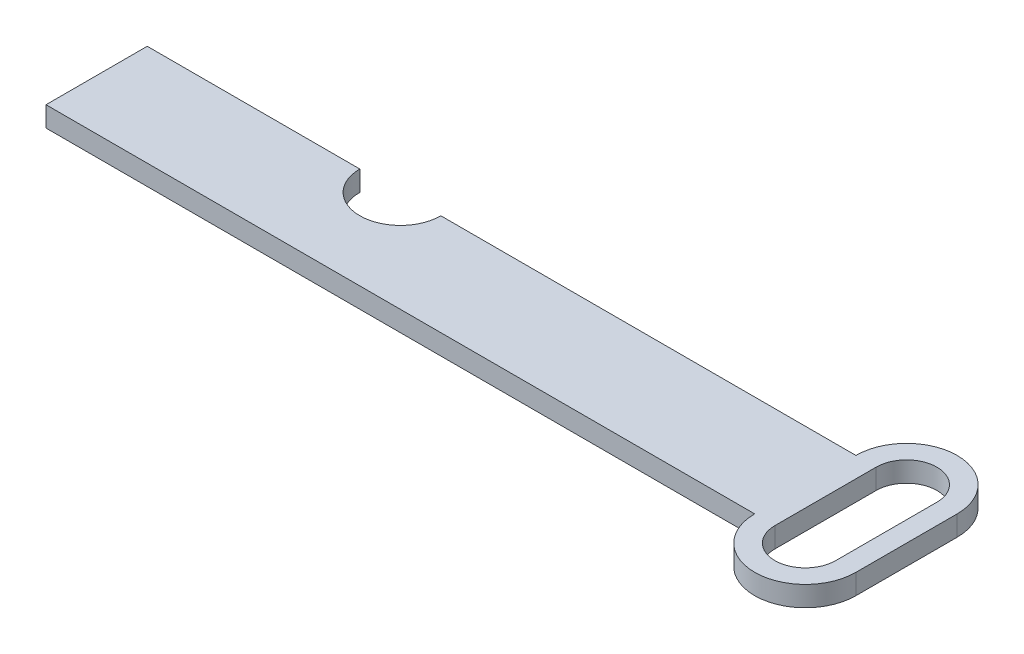
ISO-10303-21;
HEADER;
FILE_DESCRIPTION(('STEP AP214'),'2;1');
FILE_NAME('part.step','',(''),(''),'','','');
FILE_SCHEMA(('AUTOMOTIVE_DESIGN { 1 0 10303 214 1 1 1 1 }'));
ENDSEC;
DATA;
#1=APPLICATION_CONTEXT('core data for automotive mechanical design processes');
#2=APPLICATION_PROTOCOL_DEFINITION('international standard','automotive_design',2000,#1);
#3=PRODUCT_CONTEXT('',#1,'mechanical');
#4=PRODUCT('Part','Part','',(#3));
#5=PRODUCT_RELATED_PRODUCT_CATEGORY('part','',(#4));
#6=PRODUCT_DEFINITION_FORMATION('','',#4);
#7=PRODUCT_DEFINITION_CONTEXT('part definition',#1,'design');
#8=PRODUCT_DEFINITION('design','',#6,#7);
#9=PRODUCT_DEFINITION_SHAPE('','',#8);
#10=(LENGTH_UNIT() NAMED_UNIT(*) SI_UNIT(.MILLI.,.METRE.));
#11=(NAMED_UNIT(*) PLANE_ANGLE_UNIT() SI_UNIT($,.RADIAN.));
#12=(NAMED_UNIT(*) SI_UNIT($,.STERADIAN.) SOLID_ANGLE_UNIT());
#13=UNCERTAINTY_MEASURE_WITH_UNIT(LENGTH_MEASURE(1.E-05),#10,'distance_accuracy_value','');
#14=(GEOMETRIC_REPRESENTATION_CONTEXT(3) GLOBAL_UNCERTAINTY_ASSIGNED_CONTEXT((#13)) GLOBAL_UNIT_ASSIGNED_CONTEXT((#10,
#11,#12)) REPRESENTATION_CONTEXT('',''));
#15=CARTESIAN_POINT('',(0.,0.,0.));
#16=DIRECTION('',(0.,0.,1.));
#17=DIRECTION('',(1.,0.,0.));
#18=AXIS2_PLACEMENT_3D('',#15,#16,#17);
#19=CARTESIAN_POINT('',(25.,2.,-9.99999999999999));
#20=DIRECTION('',(0.,-1.,0.));
#21=DIRECTION('',(0.,0.,-1.));
#22=AXIS2_PLACEMENT_3D('',#19,#20,#21);
#23=CYLINDRICAL_SURFACE('',#22,4.);
#24=CARTESIAN_POINT('',(25.,0.,-9.99999999999999));
#25=DIRECTION('',(0.,1.,0.));
#26=DIRECTION('',(0.,0.,1.));
#27=AXIS2_PLACEMENT_3D('',#24,#25,#26);
#28=CIRCLE('',#27,4.);
#29=CARTESIAN_POINT('',(21.,0.,-9.99999999999999));
#30=VERTEX_POINT('',#29);
#31=CARTESIAN_POINT('',(29.,0.,-9.99999999999999));
#32=VERTEX_POINT('',#31);
#33=EDGE_CURVE('E162',#30,#32,#28,.T.);
#34=ORIENTED_EDGE('',*,*,#33,.F.);
#35=DIRECTION('',(0.,-1.,0.));
#36=VECTOR('',#35,1.);
#37=CARTESIAN_POINT('',(21.,2.,-9.99999999999999));
#38=LINE('',#37,#36);
#39=CARTESIAN_POINT('',(21.,2.,-9.99999999999999));
#40=VERTEX_POINT('',#39);
#41=EDGE_CURVE('E11',#40,#30,#38,.T.);
#42=ORIENTED_EDGE('',*,*,#41,.F.);
#43=CARTESIAN_POINT('',(25.,2.,-9.99999999999999));
#44=DIRECTION('',(0.,1.,0.));
#45=DIRECTION('',(0.,0.,1.));
#46=AXIS2_PLACEMENT_3D('',#43,#44,#45);
#47=CIRCLE('',#46,4.);
#48=CARTESIAN_POINT('',(29.,2.,-9.99999999999999));
#49=VERTEX_POINT('',#48);
#50=EDGE_CURVE('E174',#40,#49,#47,.T.);
#51=ORIENTED_EDGE('',*,*,#50,.T.);
#52=DIRECTION('',(0.,-1.,0.));
#53=VECTOR('',#52,1.);
#54=CARTESIAN_POINT('',(29.,2.,-9.99999999999999));
#55=LINE('',#54,#53);
#56=EDGE_CURVE('E199',#49,#32,#55,.T.);
#57=ORIENTED_EDGE('',*,*,#56,.T.);
#58=EDGE_LOOP('',(#34,#42,#51,#57));
#59=FACE_BOUND('',#58,.T.);
#60=ADVANCED_FACE('F35',(#59),#23,.F.);
#61=CARTESIAN_POINT('',(0.,2.,-9.99999999999999));
#62=DIRECTION('',(0.,0.,-1.));
#63=DIRECTION('',(-1.,0.,0.));
#64=AXIS2_PLACEMENT_3D('',#61,#62,#63);
#65=PLANE('',#64);
#66=DIRECTION('',(1.,0.,0.));
#67=VECTOR('',#66,1.);
#68=CARTESIAN_POINT('',(0.,0.,-9.99999999999999));
#69=LINE('',#68,#67);
#70=CARTESIAN_POINT('',(0.,0.,-9.99999999999999));
#71=VERTEX_POINT('',#70);
#72=EDGE_CURVE('E190',#71,#30,#69,.T.);
#73=ORIENTED_EDGE('',*,*,#72,.F.);
#74=DIRECTION('',(0.,-1.,0.));
#75=VECTOR('',#74,1.);
#76=CARTESIAN_POINT('',(0.,2.,-9.99999999999999));
#77=LINE('',#76,#75);
#78=CARTESIAN_POINT('',(0.,2.,-9.99999999999999));
#79=VERTEX_POINT('',#78);
#80=EDGE_CURVE('E42',#79,#71,#77,.T.);
#81=ORIENTED_EDGE('',*,*,#80,.F.);
#82=DIRECTION('',(1.,0.,0.));
#83=VECTOR('',#82,1.);
#84=CARTESIAN_POINT('',(0.,2.,-9.99999999999999));
#85=LINE('',#84,#83);
#86=EDGE_CURVE('E177',#79,#40,#85,.T.);
#87=ORIENTED_EDGE('',*,*,#86,.T.);
#88=ORIENTED_EDGE('',*,*,#41,.T.);
#89=EDGE_LOOP('',(#73,#81,#87,#88));
#90=FACE_BOUND('',#89,.T.);
#91=ADVANCED_FACE('F214',(#90),#65,.T.);
#92=CARTESIAN_POINT('',(0.,2.,0.));
#93=DIRECTION('',(-1.,0.,0.));
#94=DIRECTION('',(0.,0.,1.));
#95=AXIS2_PLACEMENT_3D('',#92,#93,#94);
#96=PLANE('',#95);
#97=DIRECTION('',(0.,0.,-1.));
#98=VECTOR('',#97,1.);
#99=CARTESIAN_POINT('',(0.,0.,0.));
#100=LINE('',#99,#98);
#101=CARTESIAN_POINT('',(0.,0.,0.));
#102=VERTEX_POINT('',#101);
#103=EDGE_CURVE('E193',#102,#71,#100,.T.);
#104=ORIENTED_EDGE('',*,*,#103,.F.);
#105=DIRECTION('',(0.,-1.,0.));
#106=VECTOR('',#105,1.);
#107=CARTESIAN_POINT('',(0.,2.,0.));
#108=LINE('',#107,#106);
#109=CARTESIAN_POINT('',(0.,2.,0.));
#110=VERTEX_POINT('',#109);
#111=EDGE_CURVE('E206',#110,#102,#108,.T.);
#112=ORIENTED_EDGE('',*,*,#111,.F.);
#113=DIRECTION('',(0.,0.,-1.));
#114=VECTOR('',#113,1.);
#115=CARTESIAN_POINT('',(0.,2.,0.));
#116=LINE('',#115,#114);
#117=EDGE_CURVE('E181',#110,#79,#116,.T.);
#118=ORIENTED_EDGE('',*,*,#117,.T.);
#119=ORIENTED_EDGE('',*,*,#80,.T.);
#120=EDGE_LOOP('',(#104,#112,#118,#119));
#121=FACE_BOUND('',#120,.T.);
#122=ADVANCED_FACE('F210',(#121),#96,.T.);
#123=CARTESIAN_POINT('',(0.,2.,0.));
#124=DIRECTION('',(0.,0.,1.));
#125=DIRECTION('',(1.,0.,0.));
#126=AXIS2_PLACEMENT_3D('',#123,#124,#125);
#127=PLANE('',#126);
#128=DIRECTION('',(-1.,0.,0.));
#129=VECTOR('',#128,1.);
#130=CARTESIAN_POINT('',(0.,0.,0.));
#131=LINE('',#130,#129);
#132=CARTESIAN_POINT('',(70.,0.,0.));
#133=VERTEX_POINT('',#132);
#134=EDGE_CURVE('E196',#133,#102,#131,.T.);
#135=ORIENTED_EDGE('',*,*,#134,.F.);
#136=DIRECTION('',(0.,-1.,0.));
#137=VECTOR('',#136,1.);
#138=CARTESIAN_POINT('',(70.,2.,0.));
#139=LINE('',#138,#137);
#140=CARTESIAN_POINT('',(70.,2.,0.));
#141=VERTEX_POINT('',#140);
#142=EDGE_CURVE('E204',#141,#133,#139,.T.);
#143=ORIENTED_EDGE('',*,*,#142,.F.);
#144=DIRECTION('',(-1.,0.,0.));
#145=VECTOR('',#144,1.);
#146=CARTESIAN_POINT('',(0.,2.,0.));
#147=LINE('',#146,#145);
#148=EDGE_CURVE('E185',#141,#110,#147,.T.);
#149=ORIENTED_EDGE('',*,*,#148,.T.);
#150=ORIENTED_EDGE('',*,*,#111,.T.);
#151=EDGE_LOOP('',(#135,#143,#149,#150));
#152=FACE_BOUND('',#151,.T.);
#153=ADVANCED_FACE('F222',(#152),#127,.T.);
#154=CARTESIAN_POINT('',(70.,0.,-9.99999999999999));
#155=VERTEX_POINT('',#154);
#156=EDGE_CURVE('E178',#32,#155,#69,.T.);
#157=ORIENTED_EDGE('',*,*,#156,.F.);
#158=ORIENTED_EDGE('',*,*,#56,.F.);
#159=CARTESIAN_POINT('',(70.,2.,-9.99999999999999));
#160=VERTEX_POINT('',#159);
#161=EDGE_CURVE('E182',#49,#160,#85,.T.);
#162=ORIENTED_EDGE('',*,*,#161,.T.);
#163=DIRECTION('',(0.,-1.,0.));
#164=VECTOR('',#163,1.);
#165=CARTESIAN_POINT('',(70.,2.,-9.99999999999999));
#166=LINE('',#165,#164);
#167=EDGE_CURVE('E201',#160,#155,#166,.T.);
#168=ORIENTED_EDGE('',*,*,#167,.T.);
#169=EDGE_LOOP('',(#157,#158,#162,#168));
#170=FACE_BOUND('',#169,.T.);
#171=ADVANCED_FACE('F231',(#170),#65,.T.);
#172=CARTESIAN_POINT('',(0.,2.,0.));
#173=DIRECTION('',(0.,1.,0.));
#174=DIRECTION('',(0.,0.,1.));
#175=AXIS2_PLACEMENT_3D('',#172,#173,#174);
#176=PLANE('',#175);
#177=CARTESIAN_POINT('',(75.,2.,-9.99999999999999));
#178=DIRECTION('',(0.,1.,0.));
#179=DIRECTION('',(0.,0.,1.));
#180=AXIS2_PLACEMENT_3D('',#177,#178,#179);
#181=CIRCLE('',#180,3.00000000000002);
#182=CARTESIAN_POINT('',(78.,2.,-9.99999999999999));
#183=VERTEX_POINT('',#182);
#184=CARTESIAN_POINT('',(72.,2.,-9.99999999999999));
#185=VERTEX_POINT('',#184);
#186=EDGE_CURVE('E49',#183,#185,#181,.T.);
#187=ORIENTED_EDGE('',*,*,#186,.F.);
#188=DIRECTION('',(0.,0.,-1.));
#189=VECTOR('',#188,1.);
#190=CARTESIAN_POINT('',(78.,2.,-9.99999999999999));
#191=LINE('',#190,#189);
#192=CARTESIAN_POINT('',(78.,2.,0.));
#193=VERTEX_POINT('',#192);
#194=EDGE_CURVE('E141',#193,#183,#191,.T.);
#195=ORIENTED_EDGE('',*,*,#194,.F.);
#196=CARTESIAN_POINT('',(75.,2.,0.));
#197=DIRECTION('',(0.,1.,0.));
#198=DIRECTION('',(0.,0.,1.));
#199=AXIS2_PLACEMENT_3D('',#196,#197,#198);
#200=CIRCLE('',#199,3.00000000000002);
#201=CARTESIAN_POINT('',(72.,2.,0.));
#202=VERTEX_POINT('',#201);
#203=EDGE_CURVE('E125',#202,#193,#200,.T.);
#204=ORIENTED_EDGE('',*,*,#203,.F.);
#205=DIRECTION('',(0.,0.,1.));
#206=VECTOR('',#205,1.);
#207=CARTESIAN_POINT('',(72.,2.,-9.99999999999999));
#208=LINE('',#207,#206);
#209=EDGE_CURVE('E134',#185,#202,#208,.T.);
#210=ORIENTED_EDGE('',*,*,#209,.F.);
#211=EDGE_LOOP('',(#187,#195,#204,#210));
#212=FACE_BOUND('',#211,.T.);
#213=ORIENTED_EDGE('',*,*,#50,.F.);
#214=ORIENTED_EDGE('',*,*,#86,.F.);
#215=ORIENTED_EDGE('',*,*,#117,.F.);
#216=ORIENTED_EDGE('',*,*,#148,.F.);
#217=CARTESIAN_POINT('',(75.,2.,0.));
#218=DIRECTION('',(0.,1.,0.));
#219=DIRECTION('',(0.,0.,1.));
#220=AXIS2_PLACEMENT_3D('',#217,#218,#219);
#221=CIRCLE('',#220,5.);
#222=CARTESIAN_POINT('',(80.,2.,0.));
#223=VERTEX_POINT('',#222);
#224=EDGE_CURVE('E165',#141,#223,#221,.T.);
#225=ORIENTED_EDGE('',*,*,#224,.T.);
#226=DIRECTION('',(0.,0.,-1.));
#227=VECTOR('',#226,1.);
#228=CARTESIAN_POINT('',(80.,2.,-9.99999999999999));
#229=LINE('',#228,#227);
#230=CARTESIAN_POINT('',(80.,2.,-9.99999999999999));
#231=VERTEX_POINT('',#230);
#232=EDGE_CURVE('E168',#223,#231,#229,.T.);
#233=ORIENTED_EDGE('',*,*,#232,.T.);
#234=CARTESIAN_POINT('',(75.,2.,-9.99999999999999));
#235=DIRECTION('',(0.,1.,0.));
#236=DIRECTION('',(0.,0.,1.));
#237=AXIS2_PLACEMENT_3D('',#234,#235,#236);
#238=CIRCLE('',#237,5.);
#239=EDGE_CURVE('E152',#231,#160,#238,.T.);
#240=ORIENTED_EDGE('',*,*,#239,.T.);
#241=ORIENTED_EDGE('',*,*,#161,.F.);
#242=EDGE_LOOP('',(#213,#214,#215,#216,#225,#233,#240,#241));
#243=FACE_BOUND('',#242,.T.);
#244=ADVANCED_FACE('F138',(#212,#243),#176,.T.);
#245=CARTESIAN_POINT('',(0.,0.,0.));
#246=DIRECTION('',(0.,1.,0.));
#247=DIRECTION('',(0.,0.,1.));
#248=AXIS2_PLACEMENT_3D('',#245,#246,#247);
#249=PLANE('',#248);
#250=DIRECTION('',(0.,0.,1.));
#251=VECTOR('',#250,1.);
#252=CARTESIAN_POINT('',(78.,0.,-9.99999999999999));
#253=LINE('',#252,#251);
#254=CARTESIAN_POINT('',(78.,0.,-9.99999999999999));
#255=VERTEX_POINT('',#254);
#256=CARTESIAN_POINT('',(78.,0.,0.));
#257=VERTEX_POINT('',#256);
#258=EDGE_CURVE('E359',#255,#257,#253,.T.);
#259=ORIENTED_EDGE('',*,*,#258,.F.);
#260=CARTESIAN_POINT('',(75.,0.,-9.99999999999999));
#261=DIRECTION('',(0.,1.,0.));
#262=DIRECTION('',(0.,0.,1.));
#263=AXIS2_PLACEMENT_3D('',#260,#261,#262);
#264=CIRCLE('',#263,3.00000000000002);
#265=CARTESIAN_POINT('',(72.,0.,-9.99999999999999));
#266=VERTEX_POINT('',#265);
#267=EDGE_CURVE('E153',#266,#255,#264,.F.);
#268=ORIENTED_EDGE('',*,*,#267,.F.);
#269=DIRECTION('',(0.,0.,-1.));
#270=VECTOR('',#269,1.);
#271=CARTESIAN_POINT('',(72.,0.,-9.99999999999999));
#272=LINE('',#271,#270);
#273=CARTESIAN_POINT('',(72.,0.,0.));
#274=VERTEX_POINT('',#273);
#275=EDGE_CURVE('E150',#274,#266,#272,.T.);
#276=ORIENTED_EDGE('',*,*,#275,.F.);
#277=CARTESIAN_POINT('',(75.,0.,0.));
#278=DIRECTION('',(0.,1.,0.));
#279=DIRECTION('',(0.,0.,1.));
#280=AXIS2_PLACEMENT_3D('',#277,#278,#279);
#281=CIRCLE('',#280,3.00000000000002);
#282=EDGE_CURVE('E128',#257,#274,#281,.F.);
#283=ORIENTED_EDGE('',*,*,#282,.F.);
#284=EDGE_LOOP('',(#259,#268,#276,#283));
#285=FACE_BOUND('',#284,.T.);
#286=ORIENTED_EDGE('',*,*,#33,.T.);
#287=ORIENTED_EDGE('',*,*,#156,.T.);
#288=CARTESIAN_POINT('',(75.,0.,-9.99999999999999));
#289=DIRECTION('',(0.,1.,0.));
#290=DIRECTION('',(0.,0.,1.));
#291=AXIS2_PLACEMENT_3D('',#288,#289,#290);
#292=CIRCLE('',#291,5.);
#293=CARTESIAN_POINT('',(80.,0.,-9.99999999999999));
#294=VERTEX_POINT('',#293);
#295=EDGE_CURVE('E160',#155,#294,#292,.F.);
#296=ORIENTED_EDGE('',*,*,#295,.T.);
#297=DIRECTION('',(0.,0.,1.));
#298=VECTOR('',#297,1.);
#299=CARTESIAN_POINT('',(80.,0.,-9.99999999999999));
#300=LINE('',#299,#298);
#301=CARTESIAN_POINT('',(80.,0.,0.));
#302=VERTEX_POINT('',#301);
#303=EDGE_CURVE('E157',#294,#302,#300,.T.);
#304=ORIENTED_EDGE('',*,*,#303,.T.);
#305=CARTESIAN_POINT('',(75.,0.,0.));
#306=DIRECTION('',(0.,1.,0.));
#307=DIRECTION('',(0.,0.,1.));
#308=AXIS2_PLACEMENT_3D('',#305,#306,#307);
#309=CIRCLE('',#308,5.);
#310=EDGE_CURVE('E154',#302,#133,#309,.F.);
#311=ORIENTED_EDGE('',*,*,#310,.T.);
#312=ORIENTED_EDGE('',*,*,#134,.T.);
#313=ORIENTED_EDGE('',*,*,#103,.T.);
#314=ORIENTED_EDGE('',*,*,#72,.T.);
#315=EDGE_LOOP('',(#286,#287,#296,#304,#311,#312,#313,#314));
#316=FACE_BOUND('',#315,.T.);
#317=ADVANCED_FACE('F217',(#285,#316),#249,.F.);
#318=CARTESIAN_POINT('',(75.,-22.3606797749979,-9.99999999999999));
#319=DIRECTION('',(0.,1.,0.));
#320=DIRECTION('',(0.,0.,1.));
#321=AXIS2_PLACEMENT_3D('',#318,#319,#320);
#322=CYLINDRICAL_SURFACE('',#321,5.);
#323=ORIENTED_EDGE('',*,*,#295,.F.);
#324=ORIENTED_EDGE('',*,*,#167,.F.);
#325=ORIENTED_EDGE('',*,*,#239,.F.);
#326=DIRECTION('',(0.,1.,0.));
#327=VECTOR('',#326,1.);
#328=CARTESIAN_POINT('',(80.,-22.3606797749979,-9.99999999999999));
#329=LINE('',#328,#327);
#330=EDGE_CURVE('E158',#294,#231,#329,.T.);
#331=ORIENTED_EDGE('',*,*,#330,.F.);
#332=EDGE_LOOP('',(#323,#324,#325,#331));
#333=FACE_BOUND('',#332,.T.);
#334=ADVANCED_FACE('F234',(#333),#322,.T.);
#335=CARTESIAN_POINT('',(80.,-22.3606797749979,-9.99999999999999));
#336=DIRECTION('',(1.,0.,0.));
#337=DIRECTION('',(0.,0.,-1.));
#338=AXIS2_PLACEMENT_3D('',#335,#336,#337);
#339=PLANE('',#338);
#340=ORIENTED_EDGE('',*,*,#303,.F.);
#341=ORIENTED_EDGE('',*,*,#330,.T.);
#342=ORIENTED_EDGE('',*,*,#232,.F.);
#343=DIRECTION('',(0.,1.,0.));
#344=VECTOR('',#343,1.);
#345=CARTESIAN_POINT('',(80.,-22.3606797749979,0.));
#346=LINE('',#345,#344);
#347=EDGE_CURVE('E171',#302,#223,#346,.T.);
#348=ORIENTED_EDGE('',*,*,#347,.F.);
#349=EDGE_LOOP('',(#340,#341,#342,#348));
#350=FACE_BOUND('',#349,.T.);
#351=ADVANCED_FACE('F240',(#350),#339,.T.);
#352=CARTESIAN_POINT('',(75.,-22.3606797749979,0.));
#353=DIRECTION('',(0.,1.,0.));
#354=DIRECTION('',(0.,0.,1.));
#355=AXIS2_PLACEMENT_3D('',#352,#353,#354);
#356=CYLINDRICAL_SURFACE('',#355,5.);
#357=ORIENTED_EDGE('',*,*,#310,.F.);
#358=ORIENTED_EDGE('',*,*,#347,.T.);
#359=ORIENTED_EDGE('',*,*,#224,.F.);
#360=ORIENTED_EDGE('',*,*,#142,.T.);
#361=EDGE_LOOP('',(#357,#358,#359,#360));
#362=FACE_BOUND('',#361,.T.);
#363=ADVANCED_FACE('F242',(#362),#356,.T.);
#364=CARTESIAN_POINT('',(75.,-17.0880074906351,-9.99999999999999));
#365=DIRECTION('',(0.,1.,0.));
#366=DIRECTION('',(0.,0.,1.));
#367=AXIS2_PLACEMENT_3D('',#364,#365,#366);
#368=CYLINDRICAL_SURFACE('',#367,3.00000000000002);
#369=ORIENTED_EDGE('',*,*,#267,.T.);
#370=DIRECTION('',(0.,1.,0.));
#371=VECTOR('',#370,1.);
#372=CARTESIAN_POINT('',(78.,-17.0880074906351,-9.99999999999999));
#373=LINE('',#372,#371);
#374=EDGE_CURVE('E146',#255,#183,#373,.T.);
#375=ORIENTED_EDGE('',*,*,#374,.T.);
#376=ORIENTED_EDGE('',*,*,#186,.T.);
#377=DIRECTION('',(0.,1.,0.));
#378=VECTOR('',#377,1.);
#379=CARTESIAN_POINT('',(72.,-17.0880074906351,-9.99999999999999));
#380=LINE('',#379,#378);
#381=EDGE_CURVE('E131',#266,#185,#380,.T.);
#382=ORIENTED_EDGE('',*,*,#381,.F.);
#383=EDGE_LOOP('',(#369,#375,#376,#382));
#384=FACE_BOUND('',#383,.T.);
#385=ADVANCED_FACE('F244',(#384),#368,.F.);
#386=CARTESIAN_POINT('',(78.,-17.0880074906351,-9.99999999999999));
#387=DIRECTION('',(1.,0.,0.));
#388=DIRECTION('',(0.,0.,-1.));
#389=AXIS2_PLACEMENT_3D('',#386,#387,#388);
#390=PLANE('',#389);
#391=ORIENTED_EDGE('',*,*,#258,.T.);
#392=DIRECTION('',(0.,1.,0.));
#393=VECTOR('',#392,1.);
#394=CARTESIAN_POINT('',(78.,-17.0880074906351,0.));
#395=LINE('',#394,#393);
#396=EDGE_CURVE('E130',#257,#193,#395,.T.);
#397=ORIENTED_EDGE('',*,*,#396,.T.);
#398=ORIENTED_EDGE('',*,*,#194,.T.);
#399=ORIENTED_EDGE('',*,*,#374,.F.);
#400=EDGE_LOOP('',(#391,#397,#398,#399));
#401=FACE_BOUND('',#400,.T.);
#402=ADVANCED_FACE('F250',(#401),#390,.F.);
#403=CARTESIAN_POINT('',(75.,-17.0880074906351,0.));
#404=DIRECTION('',(0.,1.,0.));
#405=DIRECTION('',(0.,0.,1.));
#406=AXIS2_PLACEMENT_3D('',#403,#404,#405);
#407=CYLINDRICAL_SURFACE('',#406,3.00000000000002);
#408=ORIENTED_EDGE('',*,*,#282,.T.);
#409=DIRECTION('',(0.,1.,0.));
#410=VECTOR('',#409,1.);
#411=CARTESIAN_POINT('',(72.,-17.0880074906351,0.));
#412=LINE('',#411,#410);
#413=EDGE_CURVE('E57',#274,#202,#412,.T.);
#414=ORIENTED_EDGE('',*,*,#413,.T.);
#415=ORIENTED_EDGE('',*,*,#203,.T.);
#416=ORIENTED_EDGE('',*,*,#396,.F.);
#417=EDGE_LOOP('',(#408,#414,#415,#416));
#418=FACE_BOUND('',#417,.T.);
#419=ADVANCED_FACE('F122',(#418),#407,.F.);
#420=CARTESIAN_POINT('',(72.,-17.0880074906351,-9.99999999999999));
#421=DIRECTION('',(-1.,0.,0.));
#422=DIRECTION('',(0.,0.,1.));
#423=AXIS2_PLACEMENT_3D('',#420,#421,#422);
#424=PLANE('',#423);
#425=ORIENTED_EDGE('',*,*,#275,.T.);
#426=ORIENTED_EDGE('',*,*,#381,.T.);
#427=ORIENTED_EDGE('',*,*,#209,.T.);
#428=ORIENTED_EDGE('',*,*,#413,.F.);
#429=EDGE_LOOP('',(#425,#426,#427,#428));
#430=FACE_BOUND('',#429,.T.);
#431=ADVANCED_FACE('F135',(#430),#424,.F.);
#432=CLOSED_SHELL('',(#60,#91,#122,#153,#171,#244,#317,#334,#351,#363,#385,#402,#419,#431));
#433=MANIFOLD_SOLID_BREP('B2',#432);
#434=ADVANCED_BREP_SHAPE_REPRESENTATION('',(#18,#433),#14);
#435=SHAPE_DEFINITION_REPRESENTATION(#9,#434);
ENDSEC;
END-ISO-10303-21;
